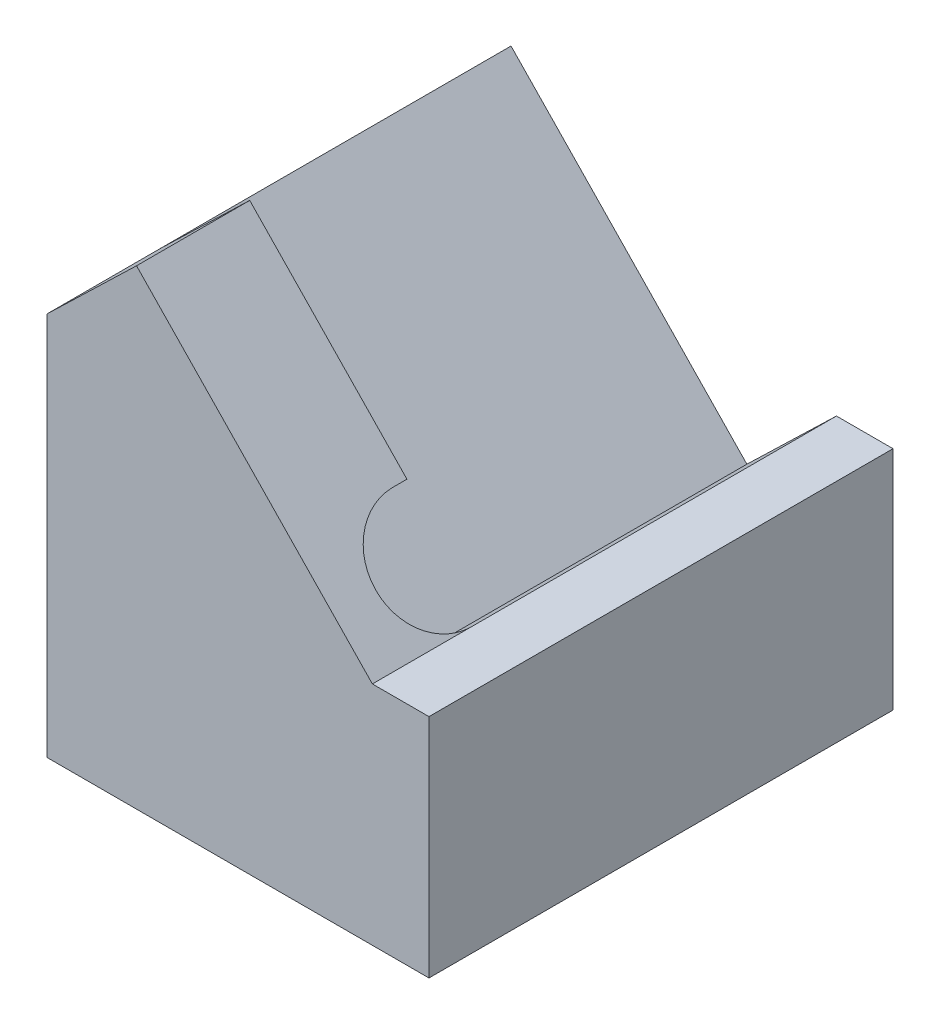
ISO-10303-21;
HEADER;
FILE_DESCRIPTION(('STEP AP214'),'2;1');
FILE_NAME('part.step','',(''),(''),'','','');
FILE_SCHEMA(('AUTOMOTIVE_DESIGN { 1 0 10303 214 1 1 1 1 }'));
ENDSEC;
DATA;
#1=APPLICATION_CONTEXT('core data for automotive mechanical design processes');
#2=APPLICATION_PROTOCOL_DEFINITION('international standard','automotive_design',2000,#1);
#3=PRODUCT_CONTEXT('',#1,'mechanical');
#4=PRODUCT('Part','Part','',(#3));
#5=PRODUCT_RELATED_PRODUCT_CATEGORY('part','',(#4));
#6=PRODUCT_DEFINITION_FORMATION('','',#4);
#7=PRODUCT_DEFINITION_CONTEXT('part definition',#1,'design');
#8=PRODUCT_DEFINITION('design','',#6,#7);
#9=PRODUCT_DEFINITION_SHAPE('','',#8);
#10=(LENGTH_UNIT() NAMED_UNIT(*) SI_UNIT(.MILLI.,.METRE.));
#11=(NAMED_UNIT(*) PLANE_ANGLE_UNIT() SI_UNIT($,.RADIAN.));
#12=(NAMED_UNIT(*) SI_UNIT($,.STERADIAN.) SOLID_ANGLE_UNIT());
#13=UNCERTAINTY_MEASURE_WITH_UNIT(LENGTH_MEASURE(1.E-05),#10,'distance_accuracy_value','');
#14=(GEOMETRIC_REPRESENTATION_CONTEXT(3) GLOBAL_UNCERTAINTY_ASSIGNED_CONTEXT((#13)) GLOBAL_UNIT_ASSIGNED_CONTEXT((#10,
#11,#12)) REPRESENTATION_CONTEXT('',''));
#15=CARTESIAN_POINT('',(0.,0.,0.));
#16=DIRECTION('',(0.,0.,1.));
#17=DIRECTION('',(1.,0.,0.));
#18=AXIS2_PLACEMENT_3D('',#15,#16,#17);
#19=CARTESIAN_POINT('',(6.75,2.,8.2));
#20=DIRECTION('',(-1.,0.,0.));
#21=DIRECTION('',(0.,0.,1.));
#22=AXIS2_PLACEMENT_3D('',#19,#20,#21);
#23=PLANE('',#22);
#24=DIRECTION('',(0.,1.,0.));
#25=VECTOR('',#24,1.);
#26=CARTESIAN_POINT('',(6.75,2.,0.));
#27=LINE('',#26,#25);
#28=CARTESIAN_POINT('',(6.75,-2.,0.));
#29=VERTEX_POINT('',#28);
#30=CARTESIAN_POINT('',(6.75,2.,0.));
#31=VERTEX_POINT('',#30);
#32=EDGE_CURVE('E72',#29,#31,#27,.T.);
#33=ORIENTED_EDGE('',*,*,#32,.T.);
#34=DIRECTION('',(0.,0.,-1.));
#35=VECTOR('',#34,1.);
#36=CARTESIAN_POINT('',(6.75,2.,8.2));
#37=LINE('',#36,#35);
#38=CARTESIAN_POINT('',(6.75,2.,8.2));
#39=VERTEX_POINT('',#38);
#40=EDGE_CURVE('E11',#39,#31,#37,.T.);
#41=ORIENTED_EDGE('',*,*,#40,.F.);
#42=DIRECTION('',(0.,1.,0.));
#43=VECTOR('',#42,1.);
#44=CARTESIAN_POINT('',(6.75,2.,8.2));
#45=LINE('',#44,#43);
#46=CARTESIAN_POINT('',(6.75,-2.,8.2));
#47=VERTEX_POINT('',#46);
#48=EDGE_CURVE('E112',#47,#39,#45,.T.);
#49=ORIENTED_EDGE('',*,*,#48,.F.);
#50=DIRECTION('',(0.,0.,1.));
#51=VECTOR('',#50,1.);
#52=CARTESIAN_POINT('',(6.75,-2.,0.));
#53=LINE('',#52,#51);
#54=EDGE_CURVE('E161',#29,#47,#53,.T.);
#55=ORIENTED_EDGE('',*,*,#54,.F.);
#56=EDGE_LOOP('',(#33,#41,#49,#55));
#57=FACE_BOUND('',#56,.T.);
#58=ADVANCED_FACE('F36',(#57),#23,.F.);
#59=CARTESIAN_POINT('',(5.75,2.,8.2));
#60=DIRECTION('',(0.,-1.,0.));
#61=DIRECTION('',(0.,0.,-1.));
#62=AXIS2_PLACEMENT_3D('',#59,#60,#61);
#63=PLANE('',#62);
#64=DIRECTION('',(-1.,0.,0.));
#65=VECTOR('',#64,1.);
#66=CARTESIAN_POINT('',(5.75,2.,0.));
#67=LINE('',#66,#65);
#68=CARTESIAN_POINT('',(5.75,2.,0.));
#69=VERTEX_POINT('',#68);
#70=EDGE_CURVE('E134',#31,#69,#67,.T.);
#71=ORIENTED_EDGE('',*,*,#70,.T.);
#72=DIRECTION('',(0.,0.,-1.));
#73=VECTOR('',#72,1.);
#74=CARTESIAN_POINT('',(5.75,2.,0.));
#75=LINE('',#74,#73);
#76=CARTESIAN_POINT('',(5.75,2.,6.45));
#77=VERTEX_POINT('',#76);
#78=EDGE_CURVE('E119',#77,#69,#75,.T.);
#79=ORIENTED_EDGE('',*,*,#78,.F.);
#80=DIRECTION('',(0.,0.,-1.));
#81=VECTOR('',#80,1.);
#82=CARTESIAN_POINT('',(5.75,2.,8.2));
#83=LINE('',#82,#81);
#84=CARTESIAN_POINT('',(5.75,2.,8.2));
#85=VERTEX_POINT('',#84);
#86=EDGE_CURVE('E43',#85,#77,#83,.T.);
#87=ORIENTED_EDGE('',*,*,#86,.F.);
#88=DIRECTION('',(-1.,0.,0.));
#89=VECTOR('',#88,1.);
#90=CARTESIAN_POINT('',(5.75,2.,8.2));
#91=LINE('',#90,#89);
#92=EDGE_CURVE('E104',#39,#85,#91,.T.);
#93=ORIENTED_EDGE('',*,*,#92,.F.);
#94=ORIENTED_EDGE('',*,*,#40,.T.);
#95=EDGE_LOOP('',(#71,#79,#87,#93,#94));
#96=FACE_BOUND('',#95,.T.);
#97=ADVANCED_FACE('F118',(#96),#63,.F.);
#98=CARTESIAN_POINT('',(1.58254756074504,6.31552333212899,8.2));
#99=DIRECTION('',(-0.719339800338653,-0.694658370458996,0.));
#100=DIRECTION('',(0.694658370458996,-0.719339800338653,0.));
#101=AXIS2_PLACEMENT_3D('',#98,#99,#100);
#102=PLANE('',#101);
#103=ORIENTED_EDGE('',*,*,#86,.T.);
#104=CARTESIAN_POINT('',(5.055341629541,2.71933980033865,6.45));
#105=DIRECTION('',(0.719339800338653,0.694658370458996,0.));
#106=DIRECTION('',(0.694658370458996,-0.719339800338653,0.));
#107=AXIS2_PLACEMENT_3D('',#104,#105,#106);
#108=CIRCLE('',#107,1.);
#109=CARTESIAN_POINT('',(4.36068325908201,3.4386796006773,6.45));
#110=VERTEX_POINT('',#109);
#111=EDGE_CURVE('E185',#110,#77,#108,.T.);
#112=ORIENTED_EDGE('',*,*,#111,.F.);
#113=DIRECTION('',(0.,0.,1.));
#114=VECTOR('',#113,1.);
#115=CARTESIAN_POINT('',(4.36068325908201,3.4386796006773,6.45));
#116=LINE('',#115,#114);
#117=CARTESIAN_POINT('',(4.36068325908201,3.4386796006773,6.2));
#118=VERTEX_POINT('',#117);
#119=EDGE_CURVE('E165',#118,#110,#116,.T.);
#120=ORIENTED_EDGE('',*,*,#119,.F.);
#121=DIRECTION('',(0.694658370458996,-0.719339800338653,0.));
#122=VECTOR('',#121,1.);
#123=CARTESIAN_POINT('',(4.36068325908201,3.4386796006773,6.2));
#124=LINE('',#123,#122);
#125=CARTESIAN_POINT('',(1.58254756074504,6.31552333212898,6.2));
#126=VERTEX_POINT('',#125);
#127=EDGE_CURVE('E162',#126,#118,#124,.T.);
#128=ORIENTED_EDGE('',*,*,#127,.F.);
#129=DIRECTION('',(0.,0.,-1.));
#130=VECTOR('',#129,1.);
#131=CARTESIAN_POINT('',(1.58254756074504,6.31552333212899,8.2));
#132=LINE('',#131,#130);
#133=CARTESIAN_POINT('',(1.58254756074504,6.31552333212899,8.2));
#134=VERTEX_POINT('',#133);
#135=EDGE_CURVE('E122',#134,#126,#132,.T.);
#136=ORIENTED_EDGE('',*,*,#135,.F.);
#137=DIRECTION('',(-0.694658370458996,0.719339800338653,0.));
#138=VECTOR('',#137,1.);
#139=CARTESIAN_POINT('',(1.58254756074504,6.31552333212899,8.2));
#140=LINE('',#139,#138);
#141=EDGE_CURVE('E108',#85,#134,#140,.T.);
#142=ORIENTED_EDGE('',*,*,#141,.F.);
#143=EDGE_LOOP('',(#103,#112,#120,#128,#136,#142));
#144=FACE_BOUND('',#143,.T.);
#145=ADVANCED_FACE('F123',(#144),#102,.F.);
#146=CARTESIAN_POINT('',(0.,4.78727491711919,8.2));
#147=DIRECTION('',(0.694658370458996,-0.719339800338652,0.));
#148=DIRECTION('',(0.719339800338652,0.694658370458996,0.));
#149=AXIS2_PLACEMENT_3D('',#146,#147,#148);
#150=PLANE('',#149);
#151=ORIENTED_EDGE('',*,*,#135,.T.);
#152=DIRECTION('',(0.719339800338653,0.694658370458996,0.));
#153=VECTOR('',#152,1.);
#154=CARTESIAN_POINT('',(0.,4.78727491711919,6.2));
#155=LINE('',#154,#153);
#156=CARTESIAN_POINT('',(0.,4.78727491711919,6.2));
#157=VERTEX_POINT('',#156);
#158=EDGE_CURVE('E145',#157,#126,#155,.T.);
#159=ORIENTED_EDGE('',*,*,#158,.F.);
#160=DIRECTION('',(0.,0.,-1.));
#161=VECTOR('',#160,1.);
#162=CARTESIAN_POINT('',(0.,4.78727491711919,8.2));
#163=LINE('',#162,#161);
#164=CARTESIAN_POINT('',(0.,4.78727491711919,8.2));
#165=VERTEX_POINT('',#164);
#166=EDGE_CURVE('E132',#165,#157,#163,.T.);
#167=ORIENTED_EDGE('',*,*,#166,.F.);
#168=DIRECTION('',(-0.719339800338653,-0.694658370458996,0.));
#169=VECTOR('',#168,1.);
#170=CARTESIAN_POINT('',(0.,4.78727491711919,8.2));
#171=LINE('',#170,#169);
#172=EDGE_CURVE('E59',#134,#165,#171,.T.);
#173=ORIENTED_EDGE('',*,*,#172,.F.);
#174=EDGE_LOOP('',(#151,#159,#167,#173));
#175=FACE_BOUND('',#174,.T.);
#176=ADVANCED_FACE('F144',(#175),#150,.F.);
#177=CARTESIAN_POINT('',(0.,0.,8.2));
#178=DIRECTION('',(1.,0.,0.));
#179=DIRECTION('',(0.,1.,0.));
#180=AXIS2_PLACEMENT_3D('',#177,#178,#179);
#181=PLANE('',#180);
#182=DIRECTION('',(0.,-1.,0.));
#183=VECTOR('',#182,1.);
#184=CARTESIAN_POINT('',(0.,0.,0.));
#185=LINE('',#184,#183);
#186=CARTESIAN_POINT('',(0.,4.78727491711919,0.));
#187=VERTEX_POINT('',#186);
#188=CARTESIAN_POINT('',(0.,-2.,0.));
#189=VERTEX_POINT('',#188);
#190=EDGE_CURVE('E137',#187,#189,#185,.T.);
#191=ORIENTED_EDGE('',*,*,#190,.T.);
#192=DIRECTION('',(0.,0.,-1.));
#193=VECTOR('',#192,1.);
#194=CARTESIAN_POINT('',(0.,-2.,0.));
#195=LINE('',#194,#193);
#196=CARTESIAN_POINT('',(0.,-2.,8.2));
#197=VERTEX_POINT('',#196);
#198=EDGE_CURVE('E151',#197,#189,#195,.T.);
#199=ORIENTED_EDGE('',*,*,#198,.F.);
#200=DIRECTION('',(0.,-1.,0.));
#201=VECTOR('',#200,1.);
#202=CARTESIAN_POINT('',(0.,0.,8.2));
#203=LINE('',#202,#201);
#204=EDGE_CURVE('E127',#165,#197,#203,.T.);
#205=ORIENTED_EDGE('',*,*,#204,.F.);
#206=ORIENTED_EDGE('',*,*,#166,.T.);
#207=DIRECTION('',(0.,0.,1.));
#208=VECTOR('',#207,1.);
#209=CARTESIAN_POINT('',(0.,4.78727491711919,6.2));
#210=LINE('',#209,#208);
#211=EDGE_CURVE('E171',#187,#157,#210,.T.);
#212=ORIENTED_EDGE('',*,*,#211,.F.);
#213=EDGE_LOOP('',(#191,#199,#205,#206,#212));
#214=FACE_BOUND('',#213,.T.);
#215=ADVANCED_FACE('F149',(#214),#181,.F.);
#216=CARTESIAN_POINT('',(0.,0.,8.2));
#217=DIRECTION('',(0.,0.,-1.));
#218=DIRECTION('',(-1.,0.,0.));
#219=AXIS2_PLACEMENT_3D('',#216,#217,#218);
#220=PLANE('',#219);
#221=ORIENTED_EDGE('',*,*,#204,.T.);
#222=DIRECTION('',(-1.,0.,0.));
#223=VECTOR('',#222,1.);
#224=CARTESIAN_POINT('',(0.,-2.,8.2));
#225=LINE('',#224,#223);
#226=EDGE_CURVE('E154',#47,#197,#225,.T.);
#227=ORIENTED_EDGE('',*,*,#226,.F.);
#228=ORIENTED_EDGE('',*,*,#48,.T.);
#229=ORIENTED_EDGE('',*,*,#92,.T.);
#230=ORIENTED_EDGE('',*,*,#141,.T.);
#231=ORIENTED_EDGE('',*,*,#172,.T.);
#232=EDGE_LOOP('',(#221,#227,#228,#229,#230,#231));
#233=FACE_BOUND('',#232,.T.);
#234=ADVANCED_FACE('F106',(#233),#220,.F.);
#235=CARTESIAN_POINT('',(0.,0.,0.));
#236=DIRECTION('',(0.,0.,-1.));
#237=DIRECTION('',(-1.,0.,0.));
#238=AXIS2_PLACEMENT_3D('',#235,#236,#237);
#239=PLANE('',#238);
#240=DIRECTION('',(0.719339800338653,0.694658370458996,0.));
#241=VECTOR('',#240,1.);
#242=CARTESIAN_POINT('',(4.16745243925496,0.471751584990209,0.));
#243=LINE('',#242,#241);
#244=CARTESIAN_POINT('',(4.16745243925496,0.471751584990208,0.));
#245=VERTEX_POINT('',#244);
#246=EDGE_CURVE('E135',#245,#69,#243,.T.);
#247=ORIENTED_EDGE('',*,*,#246,.T.);
#248=ORIENTED_EDGE('',*,*,#70,.F.);
#249=ORIENTED_EDGE('',*,*,#32,.F.);
#250=DIRECTION('',(1.,0.,0.));
#251=VECTOR('',#250,1.);
#252=CARTESIAN_POINT('',(0.,-2.,0.));
#253=LINE('',#252,#251);
#254=EDGE_CURVE('E167',#189,#29,#253,.T.);
#255=ORIENTED_EDGE('',*,*,#254,.F.);
#256=ORIENTED_EDGE('',*,*,#190,.F.);
#257=DIRECTION('',(-0.694658370458996,0.719339800338653,0.));
#258=VECTOR('',#257,1.);
#259=CARTESIAN_POINT('',(0.,4.78727491711919,0.));
#260=LINE('',#259,#258);
#261=EDGE_CURVE('E79',#245,#187,#260,.T.);
#262=ORIENTED_EDGE('',*,*,#261,.F.);
#263=EDGE_LOOP('',(#247,#248,#249,#255,#256,#262));
#264=FACE_BOUND('',#263,.T.);
#265=ADVANCED_FACE('F255',(#264),#239,.T.);
#266=CARTESIAN_POINT('',(4.16745243925496,0.471751584990209,0.));
#267=DIRECTION('',(0.694658370458996,-0.719339800338653,0.));
#268=DIRECTION('',(0.719339800338653,0.694658370458996,0.));
#269=AXIS2_PLACEMENT_3D('',#266,#267,#268);
#270=PLANE('',#269);
#271=ORIENTED_EDGE('',*,*,#78,.T.);
#272=ORIENTED_EDGE('',*,*,#246,.F.);
#273=DIRECTION('',(0.,0.,-1.));
#274=VECTOR('',#273,1.);
#275=CARTESIAN_POINT('',(4.16745243925496,0.471751584990209,0.));
#276=LINE('',#275,#274);
#277=CARTESIAN_POINT('',(4.16745243925496,0.471751584990209,6.45));
#278=VERTEX_POINT('',#277);
#279=EDGE_CURVE('E50',#278,#245,#276,.T.);
#280=ORIENTED_EDGE('',*,*,#279,.F.);
#281=DIRECTION('',(0.719339800338653,0.694658370458996,0.));
#282=VECTOR('',#281,1.);
#283=CARTESIAN_POINT('',(4.16745243925496,0.471751584990209,6.45));
#284=LINE('',#283,#282);
#285=EDGE_CURVE('E191',#278,#77,#284,.T.);
#286=ORIENTED_EDGE('',*,*,#285,.T.);
#287=EDGE_LOOP('',(#271,#272,#280,#286));
#288=FACE_BOUND('',#287,.T.);
#289=ADVANCED_FACE('F257',(#288),#270,.F.);
#290=CARTESIAN_POINT('',(3.47279406879597,1.19109138532886,6.45));
#291=DIRECTION('',(0.719339800338653,0.694658370458996,0.));
#292=DIRECTION('',(-0.694658370458996,0.719339800338653,0.));
#293=AXIS2_PLACEMENT_3D('',#290,#291,#292);
#294=CYLINDRICAL_SURFACE('',#293,1.);
#295=ORIENTED_EDGE('',*,*,#111,.T.);
#296=ORIENTED_EDGE('',*,*,#285,.F.);
#297=CARTESIAN_POINT('',(3.47279406879597,1.19109138532886,6.45));
#298=DIRECTION('',(0.719339800338653,0.694658370458996,0.));
#299=DIRECTION('',(0.694658370458996,-0.719339800338653,0.));
#300=AXIS2_PLACEMENT_3D('',#297,#298,#299);
#301=CIRCLE('',#300,1.);
#302=CARTESIAN_POINT('',(2.77813569833697,1.91043118566751,6.45));
#303=VERTEX_POINT('',#302);
#304=EDGE_CURVE('E179',#303,#278,#301,.T.);
#305=ORIENTED_EDGE('',*,*,#304,.F.);
#306=DIRECTION('',(0.719339800338653,0.694658370458996,0.));
#307=VECTOR('',#306,1.);
#308=CARTESIAN_POINT('',(2.77813569833697,1.91043118566751,6.45));
#309=LINE('',#308,#307);
#310=EDGE_CURVE('E193',#303,#110,#309,.T.);
#311=ORIENTED_EDGE('',*,*,#310,.T.);
#312=EDGE_LOOP('',(#295,#296,#305,#311));
#313=FACE_BOUND('',#312,.T.);
#314=ADVANCED_FACE('F259',(#313),#294,.F.);
#315=CARTESIAN_POINT('',(2.77813569833697,1.91043118566751,6.45));
#316=DIRECTION('',(-0.694658370458996,0.719339800338653,0.));
#317=DIRECTION('',(-0.719339800338653,-0.694658370458996,0.));
#318=AXIS2_PLACEMENT_3D('',#315,#316,#317);
#319=PLANE('',#318);
#320=ORIENTED_EDGE('',*,*,#119,.T.);
#321=ORIENTED_EDGE('',*,*,#310,.F.);
#322=DIRECTION('',(0.,0.,1.));
#323=VECTOR('',#322,1.);
#324=CARTESIAN_POINT('',(2.77813569833697,1.91043118566751,6.45));
#325=LINE('',#324,#323);
#326=CARTESIAN_POINT('',(2.77813569833697,1.91043118566751,6.2));
#327=VERTEX_POINT('',#326);
#328=EDGE_CURVE('E176',#327,#303,#325,.T.);
#329=ORIENTED_EDGE('',*,*,#328,.F.);
#330=DIRECTION('',(0.719339800338653,0.694658370458996,0.));
#331=VECTOR('',#330,1.);
#332=CARTESIAN_POINT('',(2.77813569833697,1.91043118566751,6.2));
#333=LINE('',#332,#331);
#334=EDGE_CURVE('E195',#327,#118,#333,.T.);
#335=ORIENTED_EDGE('',*,*,#334,.T.);
#336=EDGE_LOOP('',(#320,#321,#329,#335));
#337=FACE_BOUND('',#336,.T.);
#338=ADVANCED_FACE('F204',(#337),#319,.F.);
#339=CARTESIAN_POINT('',(2.77813569833697,1.91043118566751,6.2));
#340=DIRECTION('',(0.,0.,1.));
#341=DIRECTION('',(1.,0.,0.));
#342=AXIS2_PLACEMENT_3D('',#339,#340,#341);
#343=PLANE('',#342);
#344=ORIENTED_EDGE('',*,*,#127,.T.);
#345=ORIENTED_EDGE('',*,*,#334,.F.);
#346=DIRECTION('',(0.694658370458996,-0.719339800338653,0.));
#347=VECTOR('',#346,1.);
#348=CARTESIAN_POINT('',(2.77813569833697,1.91043118566751,6.2));
#349=LINE('',#348,#347);
#350=EDGE_CURVE('E173',#157,#327,#349,.T.);
#351=ORIENTED_EDGE('',*,*,#350,.F.);
#352=ORIENTED_EDGE('',*,*,#158,.T.);
#353=EDGE_LOOP('',(#344,#345,#351,#352));
#354=FACE_BOUND('',#353,.T.);
#355=ADVANCED_FACE('F199',(#354),#343,.F.);
#356=CARTESIAN_POINT('',(3.47279406879597,1.19109138532886,6.45));
#357=DIRECTION('',(-0.719339800338653,-0.694658370458996,0.));
#358=DIRECTION('',(0.694658370458996,-0.719339800338653,0.));
#359=AXIS2_PLACEMENT_3D('',#356,#357,#358);
#360=PLANE('',#359);
#361=ORIENTED_EDGE('',*,*,#211,.T.);
#362=ORIENTED_EDGE('',*,*,#350,.T.);
#363=ORIENTED_EDGE('',*,*,#328,.T.);
#364=ORIENTED_EDGE('',*,*,#304,.T.);
#365=ORIENTED_EDGE('',*,*,#279,.T.);
#366=ORIENTED_EDGE('',*,*,#261,.T.);
#367=EDGE_LOOP('',(#361,#362,#363,#364,#365,#366));
#368=FACE_BOUND('',#367,.T.);
#369=ADVANCED_FACE('F260',(#368),#360,.F.);
#370=CARTESIAN_POINT('',(0.,-2.,0.));
#371=DIRECTION('',(0.,1.,0.));
#372=DIRECTION('',(-1.,0.,0.));
#373=AXIS2_PLACEMENT_3D('',#370,#371,#372);
#374=PLANE('',#373);
#375=CARTESIAN_POINT('',(2.,-2.,4.1));
#376=DIRECTION('',(0.,-1.,0.));
#377=DIRECTION('',(0.,0.,-1.));
#378=AXIS2_PLACEMENT_3D('',#375,#376,#377);
#379=CIRCLE('',#378,0.79999999999999);
#380=CARTESIAN_POINT('',(2.,-2.,3.30000000000001));
#381=VERTEX_POINT('',#380);
#382=EDGE_CURVE('E235',#381,#381,#379,.T.);
#383=ORIENTED_EDGE('',*,*,#382,.F.);
#384=EDGE_LOOP('',(#383));
#385=FACE_BOUND('',#384,.T.);
#386=CARTESIAN_POINT('',(2.,-2.,7.1));
#387=DIRECTION('',(0.,-1.,0.));
#388=DIRECTION('',(0.,0.,-1.));
#389=AXIS2_PLACEMENT_3D('',#386,#387,#388);
#390=CIRCLE('',#389,0.749999999999989);
#391=CARTESIAN_POINT('',(2.,-2.,6.35000000000001));
#392=VERTEX_POINT('',#391);
#393=EDGE_CURVE('E234',#392,#392,#390,.T.);
#394=ORIENTED_EDGE('',*,*,#393,.F.);
#395=EDGE_LOOP('',(#394));
#396=FACE_BOUND('',#395,.T.);
#397=CARTESIAN_POINT('',(2.,-2.,1.1));
#398=DIRECTION('',(0.,-1.,0.));
#399=DIRECTION('',(0.,0.,-1.));
#400=AXIS2_PLACEMENT_3D('',#397,#398,#399);
#401=CIRCLE('',#400,0.749999999999989);
#402=CARTESIAN_POINT('',(2.,-2.,0.350000000000011));
#403=VERTEX_POINT('',#402);
#404=EDGE_CURVE('E245',#403,#403,#401,.T.);
#405=ORIENTED_EDGE('',*,*,#404,.F.);
#406=EDGE_LOOP('',(#405));
#407=FACE_BOUND('',#406,.T.);
#408=ORIENTED_EDGE('',*,*,#198,.T.);
#409=ORIENTED_EDGE('',*,*,#254,.T.);
#410=ORIENTED_EDGE('',*,*,#54,.T.);
#411=ORIENTED_EDGE('',*,*,#226,.T.);
#412=EDGE_LOOP('',(#408,#409,#410,#411));
#413=FACE_BOUND('',#412,.T.);
#414=ADVANCED_FACE('F158',(#385,#396,#407,#413),#374,.F.);
#415=CARTESIAN_POINT('',(2.,1.,1.1));
#416=DIRECTION('',(0.,-1.,0.));
#417=DIRECTION('',(0.,0.,-1.));
#418=AXIS2_PLACEMENT_3D('',#415,#416,#417);
#419=CONICAL_SURFACE('',#418,0.749999999999987,1.02974425867665);
#420=CARTESIAN_POINT('',(2.,1.45064546427067,1.1));
#421=VERTEX_POINT('',#420);
#422=VERTEX_LOOP('',#421);
#423=FACE_BOUND('',#422,.T.);
#424=CARTESIAN_POINT('',(2.,1.,1.1));
#425=DIRECTION('',(0.,-1.,0.));
#426=DIRECTION('',(0.,0.,-1.));
#427=AXIS2_PLACEMENT_3D('',#424,#425,#426);
#428=CIRCLE('',#427,0.749999999999987);
#429=CARTESIAN_POINT('',(2.,1.,0.350000000000013));
#430=VERTEX_POINT('',#429);
#431=EDGE_CURVE('E248',#430,#430,#428,.T.);
#432=ORIENTED_EDGE('',*,*,#431,.T.);
#433=EDGE_LOOP('',(#432));
#434=FACE_BOUND('',#433,.T.);
#435=ADVANCED_FACE('F267',(#423,#434),#419,.F.);
#436=CARTESIAN_POINT('',(2.,-2.,1.1));
#437=DIRECTION('',(0.,-1.,0.));
#438=DIRECTION('',(0.,0.,-1.));
#439=AXIS2_PLACEMENT_3D('',#436,#437,#438);
#440=CYLINDRICAL_SURFACE('',#439,0.749999999999988);
#441=ORIENTED_EDGE('',*,*,#431,.F.);
#442=EDGE_LOOP('',(#441));
#443=FACE_BOUND('',#442,.T.);
#444=ORIENTED_EDGE('',*,*,#404,.T.);
#445=EDGE_LOOP('',(#444));
#446=FACE_BOUND('',#445,.T.);
#447=ADVANCED_FACE('F348',(#443,#446),#440,.F.);
#448=CARTESIAN_POINT('',(2.,1.,7.1));
#449=DIRECTION('',(0.,-1.,0.));
#450=DIRECTION('',(0.,0.,-1.));
#451=AXIS2_PLACEMENT_3D('',#448,#449,#450);
#452=CONICAL_SURFACE('',#451,0.749999999999987,1.02974425867665);
#453=CARTESIAN_POINT('',(2.,1.45064546427067,7.1));
#454=VERTEX_POINT('',#453);
#455=VERTEX_LOOP('',#454);
#456=FACE_BOUND('',#455,.T.);
#457=CARTESIAN_POINT('',(2.,1.,7.1));
#458=DIRECTION('',(0.,-1.,0.));
#459=DIRECTION('',(0.,0.,-1.));
#460=AXIS2_PLACEMENT_3D('',#457,#458,#459);
#461=CIRCLE('',#460,0.749999999999987);
#462=CARTESIAN_POINT('',(2.,1.,6.35000000000001));
#463=VERTEX_POINT('',#462);
#464=EDGE_CURVE('E238',#463,#463,#461,.T.);
#465=ORIENTED_EDGE('',*,*,#464,.T.);
#466=EDGE_LOOP('',(#465));
#467=FACE_BOUND('',#466,.T.);
#468=ADVANCED_FACE('F358',(#456,#467),#452,.F.);
#469=CARTESIAN_POINT('',(2.,-2.,7.1));
#470=DIRECTION('',(0.,-1.,0.));
#471=DIRECTION('',(0.,0.,-1.));
#472=AXIS2_PLACEMENT_3D('',#469,#470,#471);
#473=CYLINDRICAL_SURFACE('',#472,0.749999999999988);
#474=ORIENTED_EDGE('',*,*,#464,.F.);
#475=EDGE_LOOP('',(#474));
#476=FACE_BOUND('',#475,.T.);
#477=ORIENTED_EDGE('',*,*,#393,.T.);
#478=EDGE_LOOP('',(#477));
#479=FACE_BOUND('',#478,.T.);
#480=ADVANCED_FACE('F228',(#476,#479),#473,.F.);
#481=CARTESIAN_POINT('',(2.,1.,4.1));
#482=DIRECTION('',(0.,-1.,0.));
#483=DIRECTION('',(0.,0.,-1.));
#484=AXIS2_PLACEMENT_3D('',#481,#482,#483);
#485=CONICAL_SURFACE('',#484,0.799999999999999,1.02974425867665);
#486=CARTESIAN_POINT('',(2.,1.48068849522205,4.1));
#487=VERTEX_POINT('',#486);
#488=VERTEX_LOOP('',#487);
#489=FACE_BOUND('',#488,.T.);
#490=CARTESIAN_POINT('',(2.,1.,4.1));
#491=DIRECTION('',(0.,-1.,0.));
#492=DIRECTION('',(0.,0.,-1.));
#493=AXIS2_PLACEMENT_3D('',#490,#491,#492);
#494=CIRCLE('',#493,0.799999999999999);
#495=CARTESIAN_POINT('',(2.,1.,3.3));
#496=VERTEX_POINT('',#495);
#497=EDGE_CURVE('E232',#496,#496,#494,.T.);
#498=ORIENTED_EDGE('',*,*,#497,.T.);
#499=EDGE_LOOP('',(#498));
#500=FACE_BOUND('',#499,.T.);
#501=ADVANCED_FACE('F224',(#489,#500),#485,.F.);
#502=CARTESIAN_POINT('',(2.,-2.,4.1));
#503=DIRECTION('',(0.,-1.,0.));
#504=DIRECTION('',(0.,0.,-1.));
#505=AXIS2_PLACEMENT_3D('',#502,#503,#504);
#506=CYLINDRICAL_SURFACE('',#505,0.799999999999994);
#507=ORIENTED_EDGE('',*,*,#497,.F.);
#508=EDGE_LOOP('',(#507));
#509=FACE_BOUND('',#508,.T.);
#510=ORIENTED_EDGE('',*,*,#382,.T.);
#511=EDGE_LOOP('',(#510));
#512=FACE_BOUND('',#511,.T.);
#513=ADVANCED_FACE('F227',(#509,#512),#506,.F.);
#514=CLOSED_SHELL('',(#58,#97,#145,#176,#215,#234,#265,#289,#314,#338,#355,#369,#414,#435,#447,
#468,#480,#501,#513));
#515=MANIFOLD_SOLID_BREP('B2',#514);
#516=ADVANCED_BREP_SHAPE_REPRESENTATION('',(#18,#515),#14);
#517=SHAPE_DEFINITION_REPRESENTATION(#9,#516);
ENDSEC;
END-ISO-10303-21;
